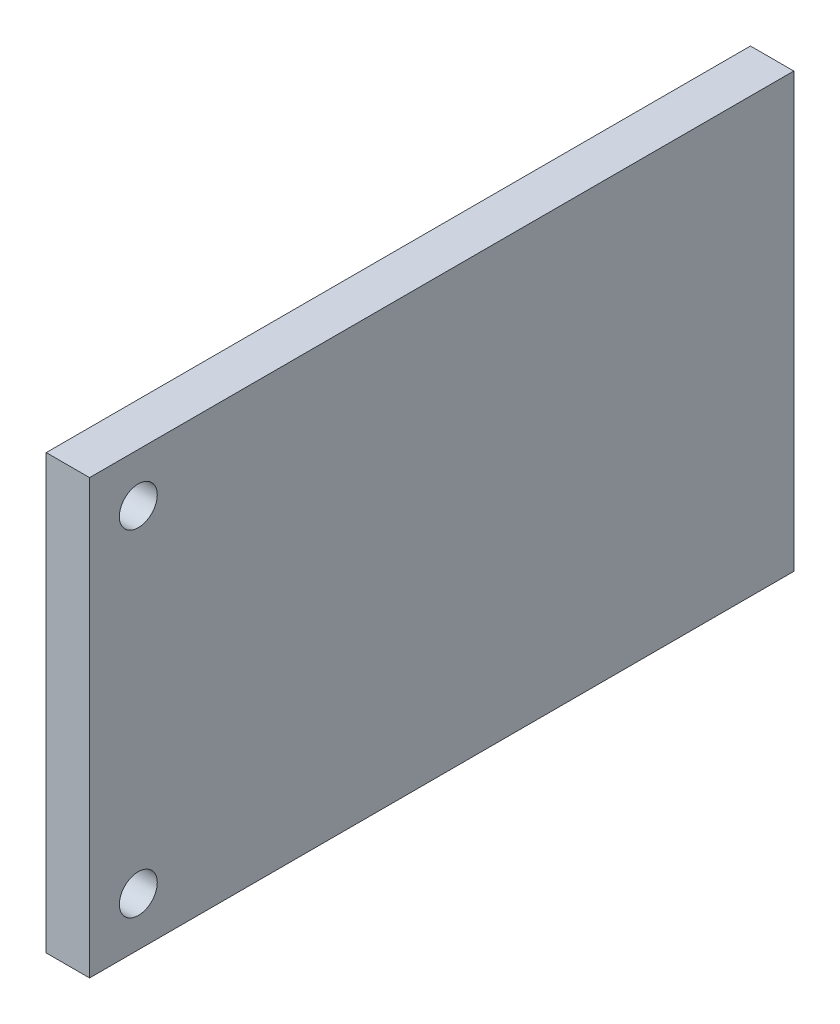
ISO-10303-21;
HEADER;
FILE_DESCRIPTION(('STEP AP214'),'2;1');
FILE_NAME('part.step','',(''),(''),'','','');
FILE_SCHEMA(('AUTOMOTIVE_DESIGN { 1 0 10303 214 1 1 1 1 }'));
ENDSEC;
DATA;
#1=APPLICATION_CONTEXT('core data for automotive mechanical design processes');
#2=APPLICATION_PROTOCOL_DEFINITION('international standard','automotive_design',2000,#1);
#3=PRODUCT_CONTEXT('',#1,'mechanical');
#4=PRODUCT('Part','Part','',(#3));
#5=PRODUCT_RELATED_PRODUCT_CATEGORY('part','',(#4));
#6=PRODUCT_DEFINITION_FORMATION('','',#4);
#7=PRODUCT_DEFINITION_CONTEXT('part definition',#1,'design');
#8=PRODUCT_DEFINITION('design','',#6,#7);
#9=PRODUCT_DEFINITION_SHAPE('','',#8);
#10=(LENGTH_UNIT() NAMED_UNIT(*) SI_UNIT(.MILLI.,.METRE.));
#11=(NAMED_UNIT(*) PLANE_ANGLE_UNIT() SI_UNIT($,.RADIAN.));
#12=(NAMED_UNIT(*) SI_UNIT($,.STERADIAN.) SOLID_ANGLE_UNIT());
#13=UNCERTAINTY_MEASURE_WITH_UNIT(LENGTH_MEASURE(1.E-05),#10,'distance_accuracy_value','');
#14=(GEOMETRIC_REPRESENTATION_CONTEXT(3) GLOBAL_UNCERTAINTY_ASSIGNED_CONTEXT((#13)) GLOBAL_UNIT_ASSIGNED_CONTEXT((#10,
#11,#12)) REPRESENTATION_CONTEXT('',''));
#15=CARTESIAN_POINT('',(0.,0.,0.));
#16=DIRECTION('',(0.,0.,1.));
#17=DIRECTION('',(1.,0.,0.));
#18=AXIS2_PLACEMENT_3D('',#15,#16,#17);
#19=CARTESIAN_POINT('',(0.,0.,0.));
#20=DIRECTION('',(-1.,0.,0.));
#21=DIRECTION('',(0.,0.,1.));
#22=AXIS2_PLACEMENT_3D('',#19,#20,#21);
#23=PLANE('',#22);
#24=CARTESIAN_POINT('',(0.,3.99999999999999,116.));
#25=DIRECTION('',(-1.,0.,0.));
#26=DIRECTION('',(0.,0.,-1.));
#27=AXIS2_PLACEMENT_3D('',#24,#25,#26);
#28=CIRCLE('',#27,3.5);
#29=CARTESIAN_POINT('',(0.,3.99999999999999,112.5));
#30=VERTEX_POINT('',#29);
#31=EDGE_CURVE('E337',#30,#30,#28,.T.);
#32=ORIENTED_EDGE('',*,*,#31,.F.);
#33=EDGE_LOOP('',(#32));
#34=FACE_BOUND('',#33,.T.);
#35=CARTESIAN_POINT('',(0.,66.,116.));
#36=DIRECTION('',(-1.,0.,0.));
#37=DIRECTION('',(0.,0.,-1.));
#38=AXIS2_PLACEMENT_3D('',#35,#36,#37);
#39=CIRCLE('',#38,3.50000000000001);
#40=CARTESIAN_POINT('',(0.,66.,112.5));
#41=VERTEX_POINT('',#40);
#42=EDGE_CURVE('E342',#41,#41,#39,.T.);
#43=ORIENTED_EDGE('',*,*,#42,.F.);
#44=EDGE_LOOP('',(#43));
#45=FACE_BOUND('',#44,.T.);
#46=DIRECTION('',(0.,0.,-1.));
#47=VECTOR('',#46,1.);
#48=CARTESIAN_POINT('',(0.,75.,125.));
#49=LINE('',#48,#47);
#50=CARTESIAN_POINT('',(0.,75.,125.));
#51=VERTEX_POINT('',#50);
#52=CARTESIAN_POINT('',(0.,75.,-5.));
#53=VERTEX_POINT('',#52);
#54=EDGE_CURVE('E350',#51,#53,#49,.T.);
#55=ORIENTED_EDGE('',*,*,#54,.T.);
#56=DIRECTION('',(0.,-1.,0.));
#57=VECTOR('',#56,1.);
#58=CARTESIAN_POINT('',(0.,75.,-5.));
#59=LINE('',#58,#57);
#60=CARTESIAN_POINT('',(0.,-5.,-5.));
#61=VERTEX_POINT('',#60);
#62=EDGE_CURVE('E374',#53,#61,#59,.T.);
#63=ORIENTED_EDGE('',*,*,#62,.T.);
#64=DIRECTION('',(0.,0.,1.));
#65=VECTOR('',#64,1.);
#66=CARTESIAN_POINT('',(0.,-5.,-5.));
#67=LINE('',#66,#65);
#68=CARTESIAN_POINT('',(0.,-5.,125.));
#69=VERTEX_POINT('',#68);
#70=EDGE_CURVE('E378',#61,#69,#67,.T.);
#71=ORIENTED_EDGE('',*,*,#70,.T.);
#72=DIRECTION('',(0.,1.,0.));
#73=VECTOR('',#72,1.);
#74=CARTESIAN_POINT('',(0.,-5.,125.));
#75=LINE('',#74,#73);
#76=EDGE_CURVE('E359',#69,#51,#75,.T.);
#77=ORIENTED_EDGE('',*,*,#76,.T.);
#78=EDGE_LOOP('',(#55,#63,#71,#77));
#79=FACE_BOUND('',#78,.T.);
#80=DIRECTION('',(0.,-0.707106781186547,0.707106781186548));
#81=VECTOR('',#80,1.);
#82=CARTESIAN_POINT('',(0.,3.87320662256458,-3.87320662256458));
#83=LINE('',#82,#81);
#84=CARTESIAN_POINT('',(0.,3.87320662256458,-3.87320662256458));
#85=VERTEX_POINT('',#84);
#86=CARTESIAN_POINT('',(0.,-3.19786118930089,3.1978611893009));
#87=VERTEX_POINT('',#86);
#88=EDGE_CURVE('E315',#85,#87,#83,.T.);
#89=ORIENTED_EDGE('',*,*,#88,.F.);
#90=DIRECTION('',(0.,-0.707106781186548,-0.707106781186547));
#91=VECTOR('',#90,1.);
#92=CARTESIAN_POINT('',(0.,3.87320662256458,-3.87320662256458));
#93=LINE('',#92,#91);
#94=CARTESIAN_POINT('',(0.,7.40874052849732,-0.337672716631846));
#95=VERTEX_POINT('',#94);
#96=EDGE_CURVE('E296',#95,#85,#93,.T.);
#97=ORIENTED_EDGE('',*,*,#96,.F.);
#98=DIRECTION('',(0.,0.707106781186547,-0.707106781186548));
#99=VECTOR('',#98,1.);
#100=CARTESIAN_POINT('',(0.,7.40874052849732,-0.337672716631846));
#101=LINE('',#100,#99);
#102=CARTESIAN_POINT('',(0.,0.337672716631848,6.73339509523363));
#103=VERTEX_POINT('',#102);
#104=EDGE_CURVE('E302',#103,#95,#101,.T.);
#105=ORIENTED_EDGE('',*,*,#104,.F.);
#106=DIRECTION('',(0.,0.707106781186548,0.707106781186547));
#107=VECTOR('',#106,1.);
#108=CARTESIAN_POINT('',(0.,-3.19786118930089,3.1978611893009));
#109=LINE('',#108,#107);
#110=EDGE_CURVE('E318',#87,#103,#109,.T.);
#111=ORIENTED_EDGE('',*,*,#110,.F.);
#112=EDGE_LOOP('',(#89,#97,#105,#111));
#113=FACE_BOUND('',#112,.T.);
#114=DIRECTION('',(0.,-0.707106781186548,0.707106781186547));
#115=VECTOR('',#114,1.);
#116=CARTESIAN_POINT('',(0.,28.6219439640938,20.8755307189646));
#117=LINE('',#116,#115);
#118=CARTESIAN_POINT('',(0.,28.6219439640938,20.8755307189646));
#119=VERTEX_POINT('',#118);
#120=CARTESIAN_POINT('',(0.,21.5508761522283,27.94659853083));
#121=VERTEX_POINT('',#120);
#122=EDGE_CURVE('E274',#119,#121,#117,.T.);
#123=ORIENTED_EDGE('',*,*,#122,.F.);
#124=DIRECTION('',(0.,-0.707106781186548,-0.707106781186547));
#125=VECTOR('',#124,1.);
#126=CARTESIAN_POINT('',(0.,28.6219439640938,20.8755307189646));
#127=LINE('',#126,#125);
#128=CARTESIAN_POINT('',(0.,32.1574778700265,24.4110646248973));
#129=VERTEX_POINT('',#128);
#130=EDGE_CURVE('E255',#129,#119,#127,.T.);
#131=ORIENTED_EDGE('',*,*,#130,.F.);
#132=DIRECTION('',(0.,0.707106781186548,-0.707106781186547));
#133=VECTOR('',#132,1.);
#134=CARTESIAN_POINT('',(0.,32.1574778700265,24.4110646248973));
#135=LINE('',#134,#133);
#136=CARTESIAN_POINT('',(0.,25.086410058161,31.4821324367628));
#137=VERTEX_POINT('',#136);
#138=EDGE_CURVE('E261',#137,#129,#135,.T.);
#139=ORIENTED_EDGE('',*,*,#138,.F.);
#140=DIRECTION('',(0.,0.707106781186548,0.707106781186547));
#141=VECTOR('',#140,1.);
#142=CARTESIAN_POINT('',(0.,21.5508761522283,27.94659853083));
#143=LINE('',#142,#141);
#144=EDGE_CURVE('E277',#121,#137,#143,.T.);
#145=ORIENTED_EDGE('',*,*,#144,.F.);
#146=EDGE_LOOP('',(#123,#131,#139,#145));
#147=FACE_BOUND('',#146,.T.);
#148=ADVANCED_FACE('F39',(#34,#45,#79,#113,#147),#23,.T.);
#149=CARTESIAN_POINT('',(8.,75.,125.));
#150=DIRECTION('',(0.,1.,0.));
#151=DIRECTION('',(0.,0.,1.));
#152=AXIS2_PLACEMENT_3D('',#149,#150,#151);
#153=PLANE('',#152);
#154=ORIENTED_EDGE('',*,*,#54,.F.);
#155=DIRECTION('',(-1.,0.,0.));
#156=VECTOR('',#155,1.);
#157=CARTESIAN_POINT('',(8.,75.,125.));
#158=LINE('',#157,#156);
#159=CARTESIAN_POINT('',(8.,75.,125.));
#160=VERTEX_POINT('',#159);
#161=EDGE_CURVE('E11',#160,#51,#158,.T.);
#162=ORIENTED_EDGE('',*,*,#161,.F.);
#163=DIRECTION('',(0.,0.,-1.));
#164=VECTOR('',#163,1.);
#165=CARTESIAN_POINT('',(8.,75.,125.));
#166=LINE('',#165,#164);
#167=CARTESIAN_POINT('',(8.,75.,-5.));
#168=VERTEX_POINT('',#167);
#169=EDGE_CURVE('E354',#160,#168,#166,.T.);
#170=ORIENTED_EDGE('',*,*,#169,.T.);
#171=DIRECTION('',(-1.,0.,0.));
#172=VECTOR('',#171,1.);
#173=CARTESIAN_POINT('',(8.,75.,-5.));
#174=LINE('',#173,#172);
#175=EDGE_CURVE('E43',#168,#53,#174,.T.);
#176=ORIENTED_EDGE('',*,*,#175,.T.);
#177=EDGE_LOOP('',(#154,#162,#170,#176));
#178=FACE_BOUND('',#177,.T.);
#179=ADVANCED_FACE('F41',(#178),#153,.T.);
#180=CARTESIAN_POINT('',(8.,-5.,125.));
#181=DIRECTION('',(0.,0.,1.));
#182=DIRECTION('',(1.,0.,0.));
#183=AXIS2_PLACEMENT_3D('',#180,#181,#182);
#184=PLANE('',#183);
#185=ORIENTED_EDGE('',*,*,#76,.F.);
#186=DIRECTION('',(-1.,0.,0.));
#187=VECTOR('',#186,1.);
#188=CARTESIAN_POINT('',(8.,-5.,125.));
#189=LINE('',#188,#187);
#190=CARTESIAN_POINT('',(8.,-5.,125.));
#191=VERTEX_POINT('',#190);
#192=EDGE_CURVE('E49',#191,#69,#189,.T.);
#193=ORIENTED_EDGE('',*,*,#192,.F.);
#194=DIRECTION('',(0.,1.,0.));
#195=VECTOR('',#194,1.);
#196=CARTESIAN_POINT('',(8.,-5.,125.));
#197=LINE('',#196,#195);
#198=EDGE_CURVE('E367',#191,#160,#197,.T.);
#199=ORIENTED_EDGE('',*,*,#198,.T.);
#200=ORIENTED_EDGE('',*,*,#161,.T.);
#201=EDGE_LOOP('',(#185,#193,#199,#200));
#202=FACE_BOUND('',#201,.T.);
#203=ADVANCED_FACE('F401',(#202),#184,.T.);
#204=CARTESIAN_POINT('',(8.,-5.,-5.));
#205=DIRECTION('',(0.,-1.,0.));
#206=DIRECTION('',(0.,0.,-1.));
#207=AXIS2_PLACEMENT_3D('',#204,#205,#206);
#208=PLANE('',#207);
#209=ORIENTED_EDGE('',*,*,#70,.F.);
#210=DIRECTION('',(-1.,0.,0.));
#211=VECTOR('',#210,1.);
#212=CARTESIAN_POINT('',(8.,-5.,-5.));
#213=LINE('',#212,#211);
#214=CARTESIAN_POINT('',(8.,-5.,-5.));
#215=VERTEX_POINT('',#214);
#216=EDGE_CURVE('E386',#215,#61,#213,.T.);
#217=ORIENTED_EDGE('',*,*,#216,.F.);
#218=DIRECTION('',(0.,0.,1.));
#219=VECTOR('',#218,1.);
#220=CARTESIAN_POINT('',(8.,-5.,-5.));
#221=LINE('',#220,#219);
#222=EDGE_CURVE('E363',#215,#191,#221,.T.);
#223=ORIENTED_EDGE('',*,*,#222,.T.);
#224=ORIENTED_EDGE('',*,*,#192,.T.);
#225=EDGE_LOOP('',(#209,#217,#223,#224));
#226=FACE_BOUND('',#225,.T.);
#227=ADVANCED_FACE('F407',(#226),#208,.T.);
#228=CARTESIAN_POINT('',(8.,75.,-5.));
#229=DIRECTION('',(0.,0.,-1.));
#230=DIRECTION('',(0.,1.,0.));
#231=AXIS2_PLACEMENT_3D('',#228,#229,#230);
#232=PLANE('',#231);
#233=ORIENTED_EDGE('',*,*,#62,.F.);
#234=ORIENTED_EDGE('',*,*,#175,.F.);
#235=DIRECTION('',(0.,-1.,0.));
#236=VECTOR('',#235,1.);
#237=CARTESIAN_POINT('',(8.,75.,-5.));
#238=LINE('',#237,#236);
#239=EDGE_CURVE('E358',#168,#215,#238,.T.);
#240=ORIENTED_EDGE('',*,*,#239,.T.);
#241=ORIENTED_EDGE('',*,*,#216,.T.);
#242=EDGE_LOOP('',(#233,#234,#240,#241));
#243=FACE_BOUND('',#242,.T.);
#244=ADVANCED_FACE('F396',(#243),#232,.T.);
#245=CARTESIAN_POINT('',(8.,0.,0.));
#246=DIRECTION('',(-1.,0.,0.));
#247=DIRECTION('',(0.,0.,1.));
#248=AXIS2_PLACEMENT_3D('',#245,#246,#247);
#249=PLANE('',#248);
#250=CARTESIAN_POINT('',(8.,3.99999999999999,116.));
#251=DIRECTION('',(-1.,0.,0.));
#252=DIRECTION('',(0.,0.,-1.));
#253=AXIS2_PLACEMENT_3D('',#250,#251,#252);
#254=CIRCLE('',#253,3.5);
#255=CARTESIAN_POINT('',(8.,3.99999999999999,112.5));
#256=VERTEX_POINT('',#255);
#257=EDGE_CURVE('E338',#256,#256,#254,.T.);
#258=ORIENTED_EDGE('',*,*,#257,.T.);
#259=EDGE_LOOP('',(#258));
#260=FACE_BOUND('',#259,.T.);
#261=CARTESIAN_POINT('',(8.,66.,116.));
#262=DIRECTION('',(-1.,0.,0.));
#263=DIRECTION('',(0.,0.,-1.));
#264=AXIS2_PLACEMENT_3D('',#261,#262,#263);
#265=CIRCLE('',#264,3.50000000000001);
#266=CARTESIAN_POINT('',(8.,66.,112.5));
#267=VERTEX_POINT('',#266);
#268=EDGE_CURVE('E346',#267,#267,#265,.T.);
#269=ORIENTED_EDGE('',*,*,#268,.T.);
#270=EDGE_LOOP('',(#269));
#271=FACE_BOUND('',#270,.T.);
#272=ORIENTED_EDGE('',*,*,#169,.F.);
#273=ORIENTED_EDGE('',*,*,#198,.F.);
#274=ORIENTED_EDGE('',*,*,#222,.F.);
#275=ORIENTED_EDGE('',*,*,#239,.F.);
#276=EDGE_LOOP('',(#272,#273,#274,#275));
#277=FACE_BOUND('',#276,.T.);
#278=ADVANCED_FACE('F404',(#260,#271,#277),#249,.F.);
#279=CARTESIAN_POINT('',(8.,66.,116.));
#280=DIRECTION('',(-1.,0.,0.));
#281=DIRECTION('',(0.,0.,1.));
#282=AXIS2_PLACEMENT_3D('',#279,#280,#281);
#283=CYLINDRICAL_SURFACE('',#282,3.50000000000001);
#284=ORIENTED_EDGE('',*,*,#268,.F.);
#285=EDGE_LOOP('',(#284));
#286=FACE_BOUND('',#285,.T.);
#287=ORIENTED_EDGE('',*,*,#42,.T.);
#288=EDGE_LOOP('',(#287));
#289=FACE_BOUND('',#288,.T.);
#290=ADVANCED_FACE('F428',(#286,#289),#283,.F.);
#291=CARTESIAN_POINT('',(8.,3.99999999999999,116.));
#292=DIRECTION('',(-1.,0.,0.));
#293=DIRECTION('',(0.,0.,1.));
#294=AXIS2_PLACEMENT_3D('',#291,#292,#293);
#295=CYLINDRICAL_SURFACE('',#294,3.5);
#296=ORIENTED_EDGE('',*,*,#257,.F.);
#297=EDGE_LOOP('',(#296));
#298=FACE_BOUND('',#297,.T.);
#299=ORIENTED_EDGE('',*,*,#31,.T.);
#300=EDGE_LOOP('',(#299));
#301=FACE_BOUND('',#300,.T.);
#302=ADVANCED_FACE('F432',(#298,#301),#295,.F.);
#303=CARTESIAN_POINT('',(-6.,3.87320662256458,-3.87320662256458));
#304=DIRECTION('',(0.,-0.707106781186547,0.707106781186548));
#305=DIRECTION('',(0.,-0.707106781186548,-0.707106781186547));
#306=AXIS2_PLACEMENT_3D('',#303,#304,#305);
#307=PLANE('',#306);
#308=ORIENTED_EDGE('',*,*,#96,.T.);
#309=DIRECTION('',(1.,0.,0.));
#310=VECTOR('',#309,1.);
#311=CARTESIAN_POINT('',(-6.,3.87320662256458,-3.87320662256458));
#312=LINE('',#311,#310);
#313=CARTESIAN_POINT('',(-6.,3.87320662256458,-3.87320662256458));
#314=VERTEX_POINT('',#313);
#315=EDGE_CURVE('E334',#314,#85,#312,.T.);
#316=ORIENTED_EDGE('',*,*,#315,.F.);
#317=DIRECTION('',(0.,-0.707106781186548,-0.707106781186547));
#318=VECTOR('',#317,1.);
#319=CARTESIAN_POINT('',(-6.,3.87320662256458,-3.87320662256458));
#320=LINE('',#319,#318);
#321=CARTESIAN_POINT('',(-6.,7.40874052849732,-0.337672716631846));
#322=VERTEX_POINT('',#321);
#323=EDGE_CURVE('E297',#322,#314,#320,.T.);
#324=ORIENTED_EDGE('',*,*,#323,.F.);
#325=DIRECTION('',(1.,0.,0.));
#326=VECTOR('',#325,1.);
#327=CARTESIAN_POINT('',(-6.,7.40874052849732,-0.337672716631846));
#328=LINE('',#327,#326);
#329=EDGE_CURVE('E311',#322,#95,#328,.T.);
#330=ORIENTED_EDGE('',*,*,#329,.T.);
#331=EDGE_LOOP('',(#308,#316,#324,#330));
#332=FACE_BOUND('',#331,.T.);
#333=ADVANCED_FACE('F436',(#332),#307,.F.);
#334=CARTESIAN_POINT('',(-6.,3.87320662256458,-3.87320662256458));
#335=DIRECTION('',(0.,0.707106781186548,0.707106781186547));
#336=DIRECTION('',(0.,-0.707106781186547,0.707106781186548));
#337=AXIS2_PLACEMENT_3D('',#334,#335,#336);
#338=PLANE('',#337);
#339=DIRECTION('',(1.,0.,0.));
#340=VECTOR('',#339,1.);
#341=CARTESIAN_POINT('',(-4.,2.4589930601915,-2.45899306019147));
#342=LINE('',#341,#340);
#343=CARTESIAN_POINT('',(-4.,2.45899306019148,-2.45899306019149));
#344=VERTEX_POINT('',#343);
#345=CARTESIAN_POINT('',(-2.,2.4589930601915,-2.45899306019147));
#346=VERTEX_POINT('',#345);
#347=EDGE_CURVE('E191',#344,#346,#342,.T.);
#348=ORIENTED_EDGE('',*,*,#347,.F.);
#349=DIRECTION('',(0.,0.707106781186551,-0.707106781186544));
#350=VECTOR('',#349,1.);
#351=CARTESIAN_POINT('',(-4.,2.4589930601915,-2.45899306019147));
#352=LINE('',#351,#350);
#353=CARTESIAN_POINT('',(-4.,-1.78364762692781,1.78364762692779));
#354=VERTEX_POINT('',#353);
#355=EDGE_CURVE('E57',#354,#344,#352,.T.);
#356=ORIENTED_EDGE('',*,*,#355,.F.);
#357=DIRECTION('',(-1.,0.,0.));
#358=VECTOR('',#357,1.);
#359=CARTESIAN_POINT('',(-4.,-1.78364762692781,1.78364762692779));
#360=LINE('',#359,#358);
#361=CARTESIAN_POINT('',(-2.,-1.78364762692781,1.78364762692779));
#362=VERTEX_POINT('',#361);
#363=EDGE_CURVE('E200',#362,#354,#360,.T.);
#364=ORIENTED_EDGE('',*,*,#363,.F.);
#365=DIRECTION('',(0.,-0.707106781186551,0.707106781186544));
#366=VECTOR('',#365,1.);
#367=CARTESIAN_POINT('',(-2.,2.4589930601915,-2.45899306019147));
#368=LINE('',#367,#366);
#369=EDGE_CURVE('E181',#346,#362,#368,.T.);
#370=ORIENTED_EDGE('',*,*,#369,.F.);
#371=EDGE_LOOP('',(#348,#356,#364,#370));
#372=FACE_BOUND('',#371,.T.);
#373=ORIENTED_EDGE('',*,*,#88,.T.);
#374=DIRECTION('',(1.,0.,0.));
#375=VECTOR('',#374,1.);
#376=CARTESIAN_POINT('',(-6.,-3.19786118930089,3.1978611893009));
#377=LINE('',#376,#375);
#378=CARTESIAN_POINT('',(-6.,-3.19786118930089,3.1978611893009));
#379=VERTEX_POINT('',#378);
#380=EDGE_CURVE('E330',#379,#87,#377,.T.);
#381=ORIENTED_EDGE('',*,*,#380,.F.);
#382=DIRECTION('',(0.,-0.707106781186547,0.707106781186548));
#383=VECTOR('',#382,1.);
#384=CARTESIAN_POINT('',(-6.,3.87320662256458,-3.87320662256458));
#385=LINE('',#384,#383);
#386=EDGE_CURVE('E301',#314,#379,#385,.T.);
#387=ORIENTED_EDGE('',*,*,#386,.F.);
#388=ORIENTED_EDGE('',*,*,#315,.T.);
#389=EDGE_LOOP('',(#373,#381,#387,#388));
#390=FACE_BOUND('',#389,.T.);
#391=ADVANCED_FACE('F197',(#372,#390),#338,.F.);
#392=CARTESIAN_POINT('',(-6.,-3.19786118930089,3.1978611893009));
#393=DIRECTION('',(0.,0.707106781186547,-0.707106781186548));
#394=DIRECTION('',(0.,0.707106781186548,0.707106781186547));
#395=AXIS2_PLACEMENT_3D('',#392,#393,#394);
#396=PLANE('',#395);
#397=ORIENTED_EDGE('',*,*,#110,.T.);
#398=DIRECTION('',(1.,0.,0.));
#399=VECTOR('',#398,1.);
#400=CARTESIAN_POINT('',(-6.,0.337672716631847,6.73339509523363));
#401=LINE('',#400,#399);
#402=CARTESIAN_POINT('',(-6.,0.337672716631847,6.73339509523363));
#403=VERTEX_POINT('',#402);
#404=EDGE_CURVE('E327',#403,#103,#401,.T.);
#405=ORIENTED_EDGE('',*,*,#404,.F.);
#406=DIRECTION('',(0.,0.707106781186548,0.707106781186547));
#407=VECTOR('',#406,1.);
#408=CARTESIAN_POINT('',(-6.,-3.19786118930089,3.1978611893009));
#409=LINE('',#408,#407);
#410=EDGE_CURVE('E305',#379,#403,#409,.T.);
#411=ORIENTED_EDGE('',*,*,#410,.F.);
#412=ORIENTED_EDGE('',*,*,#380,.T.);
#413=EDGE_LOOP('',(#397,#405,#411,#412));
#414=FACE_BOUND('',#413,.T.);
#415=ADVANCED_FACE('F443',(#414),#396,.F.);
#416=CARTESIAN_POINT('',(-6.,7.40874052849732,-0.337672716631846));
#417=DIRECTION('',(0.,-0.707106781186548,-0.707106781186547));
#418=DIRECTION('',(0.,0.707106781186547,-0.707106781186548));
#419=AXIS2_PLACEMENT_3D('',#416,#417,#418);
#420=PLANE('',#419);
#421=DIRECTION('',(-1.,0.,0.));
#422=VECTOR('',#421,1.);
#423=CARTESIAN_POINT('',(-6.,1.75188627900492,5.31918153286055));
#424=LINE('',#423,#422);
#425=CARTESIAN_POINT('',(-2.,1.75188627900492,5.31918153286055));
#426=VERTEX_POINT('',#425);
#427=CARTESIAN_POINT('',(-4.,1.75188627900493,5.31918153286056));
#428=VERTEX_POINT('',#427);
#429=EDGE_CURVE('E243',#426,#428,#424,.T.);
#430=ORIENTED_EDGE('',*,*,#429,.T.);
#431=DIRECTION('',(0.,0.707106781186547,-0.707106781186548));
#432=VECTOR('',#431,1.);
#433=CARTESIAN_POINT('',(-4.,7.40874052849732,-0.337672716631846));
#434=LINE('',#433,#432);
#435=CARTESIAN_POINT('',(-4.,5.99452696612421,1.07654084574127));
#436=VERTEX_POINT('',#435);
#437=EDGE_CURVE('E251',#428,#436,#434,.T.);
#438=ORIENTED_EDGE('',*,*,#437,.T.);
#439=DIRECTION('',(1.,0.,0.));
#440=VECTOR('',#439,1.);
#441=CARTESIAN_POINT('',(-6.,5.9945269661242,1.07654084574127));
#442=LINE('',#441,#440);
#443=CARTESIAN_POINT('',(-2.,5.9945269661242,1.07654084574127));
#444=VERTEX_POINT('',#443);
#445=EDGE_CURVE('E230',#436,#444,#442,.T.);
#446=ORIENTED_EDGE('',*,*,#445,.T.);
#447=DIRECTION('',(0.,-0.707106781186547,0.707106781186548));
#448=VECTOR('',#447,1.);
#449=CARTESIAN_POINT('',(-2.,7.40874052849732,-0.337672716631846));
#450=LINE('',#449,#448);
#451=EDGE_CURVE('E184',#444,#426,#450,.T.);
#452=ORIENTED_EDGE('',*,*,#451,.T.);
#453=EDGE_LOOP('',(#430,#438,#446,#452));
#454=FACE_BOUND('',#453,.T.);
#455=ORIENTED_EDGE('',*,*,#104,.T.);
#456=ORIENTED_EDGE('',*,*,#329,.F.);
#457=DIRECTION('',(0.,0.707106781186547,-0.707106781186548));
#458=VECTOR('',#457,1.);
#459=CARTESIAN_POINT('',(-6.,7.40874052849732,-0.337672716631846));
#460=LINE('',#459,#458);
#461=EDGE_CURVE('E308',#403,#322,#460,.T.);
#462=ORIENTED_EDGE('',*,*,#461,.F.);
#463=ORIENTED_EDGE('',*,*,#404,.T.);
#464=EDGE_LOOP('',(#455,#456,#462,#463));
#465=FACE_BOUND('',#464,.T.);
#466=ADVANCED_FACE('F446',(#454,#465),#420,.F.);
#467=CARTESIAN_POINT('',(-6.,0.,0.));
#468=DIRECTION('',(1.,0.,0.));
#469=DIRECTION('',(0.,0.,-1.));
#470=AXIS2_PLACEMENT_3D('',#467,#468,#469);
#471=PLANE('',#470);
#472=ORIENTED_EDGE('',*,*,#323,.T.);
#473=ORIENTED_EDGE('',*,*,#386,.T.);
#474=ORIENTED_EDGE('',*,*,#410,.T.);
#475=ORIENTED_EDGE('',*,*,#461,.T.);
#476=EDGE_LOOP('',(#472,#473,#474,#475));
#477=FACE_BOUND('',#476,.T.);
#478=ADVANCED_FACE('F450',(#477),#471,.F.);
#479=CARTESIAN_POINT('',(-6.,28.6219439640938,20.8755307189646));
#480=DIRECTION('',(0.,-0.707106781186547,0.707106781186548));
#481=DIRECTION('',(0.,-0.707106781186548,-0.707106781186547));
#482=AXIS2_PLACEMENT_3D('',#479,#480,#481);
#483=PLANE('',#482);
#484=ORIENTED_EDGE('',*,*,#130,.T.);
#485=DIRECTION('',(1.,0.,0.));
#486=VECTOR('',#485,1.);
#487=CARTESIAN_POINT('',(-6.,28.6219439640938,20.8755307189646));
#488=LINE('',#487,#486);
#489=CARTESIAN_POINT('',(-6.,28.6219439640938,20.8755307189646));
#490=VERTEX_POINT('',#489);
#491=EDGE_CURVE('E293',#490,#119,#488,.T.);
#492=ORIENTED_EDGE('',*,*,#491,.F.);
#493=DIRECTION('',(0.,-0.707106781186548,-0.707106781186547));
#494=VECTOR('',#493,1.);
#495=CARTESIAN_POINT('',(-6.,28.6219439640938,20.8755307189646));
#496=LINE('',#495,#494);
#497=CARTESIAN_POINT('',(-6.,32.1574778700265,24.4110646248973));
#498=VERTEX_POINT('',#497);
#499=EDGE_CURVE('E256',#498,#490,#496,.T.);
#500=ORIENTED_EDGE('',*,*,#499,.F.);
#501=DIRECTION('',(1.,0.,0.));
#502=VECTOR('',#501,1.);
#503=CARTESIAN_POINT('',(-6.,32.1574778700265,24.4110646248973));
#504=LINE('',#503,#502);
#505=EDGE_CURVE('E270',#498,#129,#504,.T.);
#506=ORIENTED_EDGE('',*,*,#505,.T.);
#507=EDGE_LOOP('',(#484,#492,#500,#506));
#508=FACE_BOUND('',#507,.T.);
#509=ADVANCED_FACE('F454',(#508),#483,.F.);
#510=CARTESIAN_POINT('',(-6.,28.6219439640938,20.8755307189646));
#511=DIRECTION('',(0.,0.707106781186547,0.707106781186548));
#512=DIRECTION('',(0.,-0.707106781186548,0.707106781186547));
#513=AXIS2_PLACEMENT_3D('',#510,#511,#512);
#514=PLANE('',#513);
#515=DIRECTION('',(-1.,0.,0.));
#516=VECTOR('',#515,1.);
#517=CARTESIAN_POINT('',(-6.,27.2077304017205,22.2897442813378));
#518=LINE('',#517,#516);
#519=CARTESIAN_POINT('',(-2.,27.2077304017205,22.2897442813378));
#520=VERTEX_POINT('',#519);
#521=CARTESIAN_POINT('',(-4.,27.2077304017205,22.2897442813378));
#522=VERTEX_POINT('',#521);
#523=EDGE_CURVE('E225',#520,#522,#518,.T.);
#524=ORIENTED_EDGE('',*,*,#523,.T.);
#525=DIRECTION('',(0.,-0.707106781186548,0.707106781186547));
#526=VECTOR('',#525,1.);
#527=CARTESIAN_POINT('',(-4.,28.6219439640938,20.8755307189646));
#528=LINE('',#527,#526);
#529=CARTESIAN_POINT('',(-4.,22.9650897146012,26.5323849684571));
#530=VERTEX_POINT('',#529);
#531=EDGE_CURVE('E247',#522,#530,#528,.T.);
#532=ORIENTED_EDGE('',*,*,#531,.T.);
#533=DIRECTION('',(1.,0.,0.));
#534=VECTOR('',#533,1.);
#535=CARTESIAN_POINT('',(-6.,22.9650897146012,26.5323849684571));
#536=LINE('',#535,#534);
#537=CARTESIAN_POINT('',(-2.,22.9650897146012,26.5323849684571));
#538=VERTEX_POINT('',#537);
#539=EDGE_CURVE('E239',#530,#538,#536,.T.);
#540=ORIENTED_EDGE('',*,*,#539,.T.);
#541=DIRECTION('',(0.,0.707106781186548,-0.707106781186547));
#542=VECTOR('',#541,1.);
#543=CARTESIAN_POINT('',(-2.,28.6219439640938,20.8755307189646));
#544=LINE('',#543,#542);
#545=EDGE_CURVE('E233',#538,#520,#544,.T.);
#546=ORIENTED_EDGE('',*,*,#545,.T.);
#547=EDGE_LOOP('',(#524,#532,#540,#546));
#548=FACE_BOUND('',#547,.T.);
#549=ORIENTED_EDGE('',*,*,#122,.T.);
#550=DIRECTION('',(1.,0.,0.));
#551=VECTOR('',#550,1.);
#552=CARTESIAN_POINT('',(-6.,21.5508761522283,27.94659853083));
#553=LINE('',#552,#551);
#554=CARTESIAN_POINT('',(-6.,21.5508761522283,27.94659853083));
#555=VERTEX_POINT('',#554);
#556=EDGE_CURVE('E289',#555,#121,#553,.T.);
#557=ORIENTED_EDGE('',*,*,#556,.F.);
#558=DIRECTION('',(0.,-0.707106781186548,0.707106781186547));
#559=VECTOR('',#558,1.);
#560=CARTESIAN_POINT('',(-6.,28.6219439640938,20.8755307189646));
#561=LINE('',#560,#559);
#562=EDGE_CURVE('E260',#490,#555,#561,.T.);
#563=ORIENTED_EDGE('',*,*,#562,.F.);
#564=ORIENTED_EDGE('',*,*,#491,.T.);
#565=EDGE_LOOP('',(#549,#557,#563,#564));
#566=FACE_BOUND('',#565,.T.);
#567=ADVANCED_FACE('F458',(#548,#566),#514,.F.);
#568=CARTESIAN_POINT('',(-6.,21.5508761522283,27.94659853083));
#569=DIRECTION('',(0.,0.707106781186547,-0.707106781186548));
#570=DIRECTION('',(0.,0.707106781186548,0.707106781186547));
#571=AXIS2_PLACEMENT_3D('',#568,#569,#570);
#572=PLANE('',#571);
#573=ORIENTED_EDGE('',*,*,#144,.T.);
#574=DIRECTION('',(1.,0.,0.));
#575=VECTOR('',#574,1.);
#576=CARTESIAN_POINT('',(-6.,25.086410058161,31.4821324367628));
#577=LINE('',#576,#575);
#578=CARTESIAN_POINT('',(-6.,25.086410058161,31.4821324367628));
#579=VERTEX_POINT('',#578);
#580=EDGE_CURVE('E286',#579,#137,#577,.T.);
#581=ORIENTED_EDGE('',*,*,#580,.F.);
#582=DIRECTION('',(0.,0.707106781186548,0.707106781186547));
#583=VECTOR('',#582,1.);
#584=CARTESIAN_POINT('',(-6.,21.5508761522283,27.94659853083));
#585=LINE('',#584,#583);
#586=EDGE_CURVE('E264',#555,#579,#585,.T.);
#587=ORIENTED_EDGE('',*,*,#586,.F.);
#588=ORIENTED_EDGE('',*,*,#556,.T.);
#589=EDGE_LOOP('',(#573,#581,#587,#588));
#590=FACE_BOUND('',#589,.T.);
#591=ADVANCED_FACE('F462',(#590),#572,.F.);
#592=CARTESIAN_POINT('',(-6.,32.1574778700265,24.4110646248973));
#593=DIRECTION('',(0.,-0.707106781186547,-0.707106781186548));
#594=DIRECTION('',(0.,0.707106781186548,-0.707106781186547));
#595=AXIS2_PLACEMENT_3D('',#592,#593,#594);
#596=PLANE('',#595);
#597=DIRECTION('',(1.,0.,0.));
#598=VECTOR('',#597,1.);
#599=CARTESIAN_POINT('',(-4.,26.500623620534,30.0679188743898));
#600=LINE('',#599,#598);
#601=CARTESIAN_POINT('',(-4.,26.500623620534,30.0679188743898));
#602=VERTEX_POINT('',#601);
#603=CARTESIAN_POINT('',(-2.,26.500623620534,30.0679188743898));
#604=VERTEX_POINT('',#603);
#605=EDGE_CURVE('E501',#602,#604,#600,.T.);
#606=ORIENTED_EDGE('',*,*,#605,.F.);
#607=DIRECTION('',(0.,-0.707106781186548,0.707106781186547));
#608=VECTOR('',#607,1.);
#609=CARTESIAN_POINT('',(-4.,30.7432643076532,25.8252781872706));
#610=LINE('',#609,#608);
#611=CARTESIAN_POINT('',(-4.,30.7432643076532,25.8252781872706));
#612=VERTEX_POINT('',#611);
#613=EDGE_CURVE('E226',#612,#602,#610,.T.);
#614=ORIENTED_EDGE('',*,*,#613,.F.);
#615=DIRECTION('',(-1.,0.,0.));
#616=VECTOR('',#615,1.);
#617=CARTESIAN_POINT('',(-4.,30.7432643076532,25.8252781872706));
#618=LINE('',#617,#616);
#619=CARTESIAN_POINT('',(-2.,30.7432643076532,25.8252781872706));
#620=VERTEX_POINT('',#619);
#621=EDGE_CURVE('E222',#620,#612,#618,.T.);
#622=ORIENTED_EDGE('',*,*,#621,.F.);
#623=DIRECTION('',(0.,0.707106781186548,-0.707106781186547));
#624=VECTOR('',#623,1.);
#625=CARTESIAN_POINT('',(-2.,30.7432643076532,25.8252781872706));
#626=LINE('',#625,#624);
#627=EDGE_CURVE('E211',#604,#620,#626,.T.);
#628=ORIENTED_EDGE('',*,*,#627,.F.);
#629=EDGE_LOOP('',(#606,#614,#622,#628));
#630=FACE_BOUND('',#629,.T.);
#631=ORIENTED_EDGE('',*,*,#138,.T.);
#632=ORIENTED_EDGE('',*,*,#505,.F.);
#633=DIRECTION('',(0.,0.707106781186548,-0.707106781186547));
#634=VECTOR('',#633,1.);
#635=CARTESIAN_POINT('',(-6.,32.1574778700265,24.4110646248973));
#636=LINE('',#635,#634);
#637=EDGE_CURVE('E267',#579,#498,#636,.T.);
#638=ORIENTED_EDGE('',*,*,#637,.F.);
#639=ORIENTED_EDGE('',*,*,#580,.T.);
#640=EDGE_LOOP('',(#631,#632,#638,#639));
#641=FACE_BOUND('',#640,.T.);
#642=ADVANCED_FACE('F466',(#630,#641),#596,.F.);
#643=CARTESIAN_POINT('',(-6.,0.,0.));
#644=DIRECTION('',(1.,0.,0.));
#645=DIRECTION('',(0.,0.,-1.));
#646=AXIS2_PLACEMENT_3D('',#643,#644,#645);
#647=PLANE('',#646);
#648=ORIENTED_EDGE('',*,*,#499,.T.);
#649=ORIENTED_EDGE('',*,*,#562,.T.);
#650=ORIENTED_EDGE('',*,*,#586,.T.);
#651=ORIENTED_EDGE('',*,*,#637,.T.);
#652=EDGE_LOOP('',(#648,#649,#650,#651));
#653=FACE_BOUND('',#652,.T.);
#654=ADVANCED_FACE('F470',(#653),#647,.F.);
#655=CARTESIAN_POINT('',(-4.,35.2154002626528,30.2974141422702));
#656=DIRECTION('',(0.,0.707106781186551,-0.707106781186544));
#657=DIRECTION('',(0.,0.707106781186544,0.707106781186551));
#658=AXIS2_PLACEMENT_3D('',#655,#656,#657);
#659=PLANE('',#658);
#660=DIRECTION('',(0.,-0.707106781186544,-0.707106781186551));
#661=VECTOR('',#660,1.);
#662=CARTESIAN_POINT('',(-2.,35.2154002626528,30.2974141422702));
#663=LINE('',#662,#661);
#664=EDGE_CURVE('E187',#620,#520,#663,.T.);
#665=ORIENTED_EDGE('',*,*,#664,.F.);
#666=ORIENTED_EDGE('',*,*,#621,.T.);
#667=DIRECTION('',(0.,-0.707106781186544,-0.707106781186551));
#668=VECTOR('',#667,1.);
#669=CARTESIAN_POINT('',(-4.,35.2154002626528,30.2974141422702));
#670=LINE('',#669,#668);
#671=EDGE_CURVE('E188',#612,#522,#670,.T.);
#672=ORIENTED_EDGE('',*,*,#671,.T.);
#673=ORIENTED_EDGE('',*,*,#523,.F.);
#674=EDGE_LOOP('',(#665,#666,#672,#673));
#675=FACE_BOUND('',#674,.T.);
#676=ADVANCED_FACE('F474',(#675),#659,.F.);
#677=CARTESIAN_POINT('',(-2.,35.2154002626528,30.2974141422702));
#678=DIRECTION('',(1.,0.,0.));
#679=DIRECTION('',(0.,0.,-1.));
#680=AXIS2_PLACEMENT_3D('',#677,#678,#679);
#681=PLANE('',#680);
#682=DIRECTION('',(0.,-0.707106781186544,-0.707106781186551));
#683=VECTOR('',#682,1.);
#684=CARTESIAN_POINT('',(-2.,30.9727595755335,34.5400548293894));
#685=LINE('',#684,#683);
#686=EDGE_CURVE('E213',#604,#538,#685,.T.);
#687=ORIENTED_EDGE('',*,*,#686,.F.);
#688=ORIENTED_EDGE('',*,*,#627,.T.);
#689=ORIENTED_EDGE('',*,*,#664,.T.);
#690=ORIENTED_EDGE('',*,*,#545,.F.);
#691=EDGE_LOOP('',(#687,#688,#689,#690));
#692=FACE_BOUND('',#691,.T.);
#693=ADVANCED_FACE('F485',(#692),#681,.F.);
#694=CARTESIAN_POINT('',(-4.,30.9727595755335,34.5400548293894));
#695=DIRECTION('',(0.,-0.707106781186551,0.707106781186544));
#696=DIRECTION('',(0.,-0.707106781186544,-0.707106781186551));
#697=AXIS2_PLACEMENT_3D('',#694,#695,#696);
#698=PLANE('',#697);
#699=DIRECTION('',(0.,-0.707106781186544,-0.707106781186551));
#700=VECTOR('',#699,1.);
#701=CARTESIAN_POINT('',(-4.,30.9727595755335,34.5400548293894));
#702=LINE('',#701,#700);
#703=EDGE_CURVE('E207',#602,#530,#702,.T.);
#704=ORIENTED_EDGE('',*,*,#703,.F.);
#705=ORIENTED_EDGE('',*,*,#605,.T.);
#706=ORIENTED_EDGE('',*,*,#686,.T.);
#707=ORIENTED_EDGE('',*,*,#539,.F.);
#708=EDGE_LOOP('',(#704,#705,#706,#707));
#709=FACE_BOUND('',#708,.T.);
#710=ADVANCED_FACE('F488',(#709),#698,.F.);
#711=CARTESIAN_POINT('',(-4.,35.2154002626528,30.2974141422702));
#712=DIRECTION('',(-1.,0.,0.));
#713=DIRECTION('',(0.,0.,1.));
#714=AXIS2_PLACEMENT_3D('',#711,#712,#713);
#715=PLANE('',#714);
#716=ORIENTED_EDGE('',*,*,#671,.F.);
#717=ORIENTED_EDGE('',*,*,#613,.T.);
#718=ORIENTED_EDGE('',*,*,#703,.T.);
#719=ORIENTED_EDGE('',*,*,#531,.F.);
#720=EDGE_LOOP('',(#716,#717,#718,#719));
#721=FACE_BOUND('',#720,.T.);
#722=ADVANCED_FACE('F480',(#721),#715,.F.);
#723=EDGE_CURVE('E212',#428,#354,#702,.T.);
#724=ORIENTED_EDGE('',*,*,#723,.T.);
#725=ORIENTED_EDGE('',*,*,#355,.T.);
#726=EDGE_CURVE('E193',#436,#344,#670,.T.);
#727=ORIENTED_EDGE('',*,*,#726,.F.);
#728=ORIENTED_EDGE('',*,*,#437,.F.);
#729=EDGE_LOOP('',(#724,#725,#727,#728));
#730=FACE_BOUND('',#729,.T.);
#731=ADVANCED_FACE('F476',(#730),#715,.F.);
#732=EDGE_CURVE('E216',#426,#362,#685,.T.);
#733=ORIENTED_EDGE('',*,*,#732,.T.);
#734=ORIENTED_EDGE('',*,*,#363,.T.);
#735=ORIENTED_EDGE('',*,*,#723,.F.);
#736=ORIENTED_EDGE('',*,*,#429,.F.);
#737=EDGE_LOOP('',(#733,#734,#735,#736));
#738=FACE_BOUND('',#737,.T.);
#739=ADVANCED_FACE('F479',(#738),#698,.F.);
#740=EDGE_CURVE('E65',#444,#346,#663,.T.);
#741=ORIENTED_EDGE('',*,*,#740,.T.);
#742=ORIENTED_EDGE('',*,*,#369,.T.);
#743=ORIENTED_EDGE('',*,*,#732,.F.);
#744=ORIENTED_EDGE('',*,*,#451,.F.);
#745=EDGE_LOOP('',(#741,#742,#743,#744));
#746=FACE_BOUND('',#745,.T.);
#747=ADVANCED_FACE('F178',(#746),#681,.F.);
#748=ORIENTED_EDGE('',*,*,#726,.T.);
#749=ORIENTED_EDGE('',*,*,#347,.T.);
#750=ORIENTED_EDGE('',*,*,#740,.F.);
#751=ORIENTED_EDGE('',*,*,#445,.F.);
#752=EDGE_LOOP('',(#748,#749,#750,#751));
#753=FACE_BOUND('',#752,.T.);
#754=ADVANCED_FACE('F192',(#753),#659,.F.);
#755=CLOSED_SHELL('',(#148,#179,#203,#227,#244,#278,#290,#302,#333,#391,#415,#466,#478,#509,
#567,#591,#642,#654,#676,#693,#710,#722,#731,#739,#747,#754));
#756=MANIFOLD_SOLID_BREP('B2',#755);
#757=ADVANCED_BREP_SHAPE_REPRESENTATION('',(#18,#756),#14);
#758=SHAPE_DEFINITION_REPRESENTATION(#9,#757);
ENDSEC;
END-ISO-10303-21;
